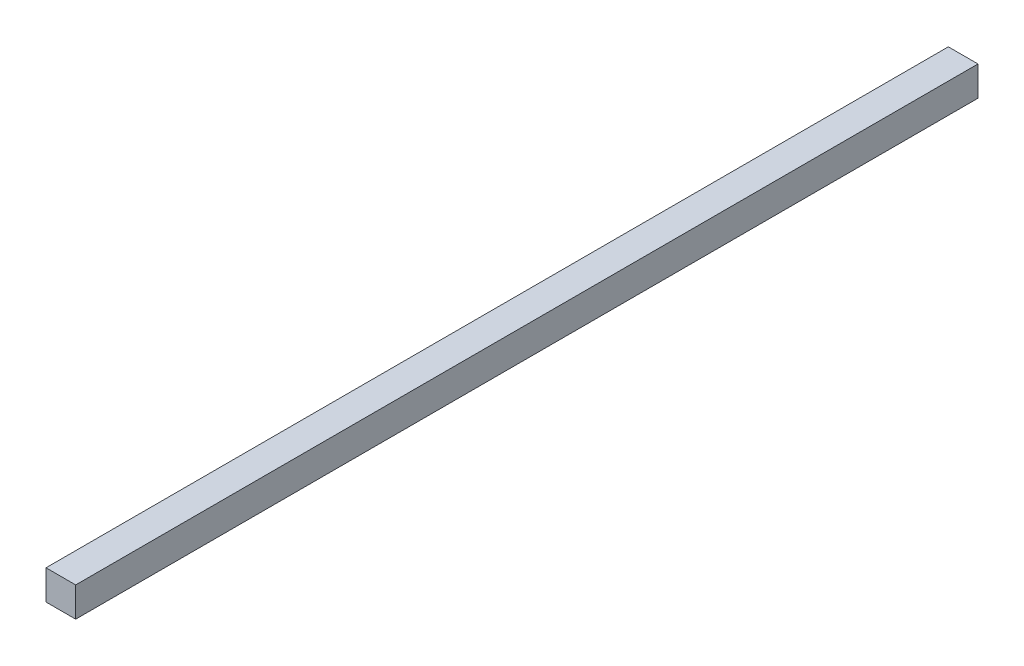
ISO-10303-21;
HEADER;
FILE_DESCRIPTION(('STEP AP214'),'2;1');
FILE_NAME('part.step','',(''),(''),'','','');
FILE_SCHEMA(('AUTOMOTIVE_DESIGN { 1 0 10303 214 1 1 1 1 }'));
ENDSEC;
DATA;
#1=APPLICATION_CONTEXT('core data for automotive mechanical design processes');
#2=APPLICATION_PROTOCOL_DEFINITION('international standard','automotive_design',2000,#1);
#3=PRODUCT_CONTEXT('',#1,'mechanical');
#4=PRODUCT('Part','Part','',(#3));
#5=PRODUCT_RELATED_PRODUCT_CATEGORY('part','',(#4));
#6=PRODUCT_DEFINITION_FORMATION('','',#4);
#7=PRODUCT_DEFINITION_CONTEXT('part definition',#1,'design');
#8=PRODUCT_DEFINITION('design','',#6,#7);
#9=PRODUCT_DEFINITION_SHAPE('','',#8);
#10=(LENGTH_UNIT() NAMED_UNIT(*) SI_UNIT(.MILLI.,.METRE.));
#11=(NAMED_UNIT(*) PLANE_ANGLE_UNIT() SI_UNIT($,.RADIAN.));
#12=(NAMED_UNIT(*) SI_UNIT($,.STERADIAN.) SOLID_ANGLE_UNIT());
#13=UNCERTAINTY_MEASURE_WITH_UNIT(LENGTH_MEASURE(1.E-05),#10,'distance_accuracy_value','');
#14=(GEOMETRIC_REPRESENTATION_CONTEXT(3) GLOBAL_UNCERTAINTY_ASSIGNED_CONTEXT((#13)) GLOBAL_UNIT_ASSIGNED_CONTEXT((#10,
#11,#12)) REPRESENTATION_CONTEXT('',''));
#15=CARTESIAN_POINT('',(0.,0.,0.));
#16=DIRECTION('',(0.,0.,1.));
#17=DIRECTION('',(1.,0.,0.));
#18=AXIS2_PLACEMENT_3D('',#15,#16,#17);
#19=CARTESIAN_POINT('',(12.7,0.,0.));
#20=DIRECTION('',(0.,1.,0.));
#21=DIRECTION('',(0.,0.,1.));
#22=AXIS2_PLACEMENT_3D('',#19,#20,#21);
#23=PLANE('',#22);
#24=DIRECTION('',(0.,0.,-1.));
#25=VECTOR('',#24,1.);
#26=CARTESIAN_POINT('',(0.,0.,0.));
#27=LINE('',#26,#25);
#28=CARTESIAN_POINT('',(0.,0.,0.));
#29=VERTEX_POINT('',#28);
#30=CARTESIAN_POINT('',(0.,0.,-386.08));
#31=VERTEX_POINT('',#30);
#32=EDGE_CURVE('E104',#29,#31,#27,.T.);
#33=ORIENTED_EDGE('',*,*,#32,.T.);
#34=DIRECTION('',(-1.,0.,0.));
#35=VECTOR('',#34,1.);
#36=CARTESIAN_POINT('',(12.7,0.,-386.08));
#37=LINE('',#36,#35);
#38=CARTESIAN_POINT('',(12.7,0.,-386.08));
#39=VERTEX_POINT('',#38);
#40=EDGE_CURVE('E11',#39,#31,#37,.T.);
#41=ORIENTED_EDGE('',*,*,#40,.F.);
#42=DIRECTION('',(0.,0.,-1.));
#43=VECTOR('',#42,1.);
#44=CARTESIAN_POINT('',(12.7,0.,0.));
#45=LINE('',#44,#43);
#46=CARTESIAN_POINT('',(12.7,0.,0.));
#47=VERTEX_POINT('',#46);
#48=EDGE_CURVE('E92',#47,#39,#45,.T.);
#49=ORIENTED_EDGE('',*,*,#48,.F.);
#50=DIRECTION('',(-1.,0.,0.));
#51=VECTOR('',#50,1.);
#52=CARTESIAN_POINT('',(12.7,0.,0.));
#53=LINE('',#52,#51);
#54=EDGE_CURVE('E100',#47,#29,#53,.T.);
#55=ORIENTED_EDGE('',*,*,#54,.T.);
#56=EDGE_LOOP('',(#33,#41,#49,#55));
#57=FACE_BOUND('',#56,.T.);
#58=ADVANCED_FACE('F41',(#57),#23,.F.);
#59=CARTESIAN_POINT('',(12.7,0.,-386.08));
#60=DIRECTION('',(0.,0.,1.));
#61=DIRECTION('',(1.,0.,0.));
#62=AXIS2_PLACEMENT_3D('',#59,#60,#61);
#63=PLANE('',#62);
#64=DIRECTION('',(0.,1.,0.));
#65=VECTOR('',#64,1.);
#66=CARTESIAN_POINT('',(0.,0.,-386.08));
#67=LINE('',#66,#65);
#68=CARTESIAN_POINT('',(0.,12.7,-386.08));
#69=VERTEX_POINT('',#68);
#70=EDGE_CURVE('E96',#31,#69,#67,.T.);
#71=ORIENTED_EDGE('',*,*,#70,.T.);
#72=DIRECTION('',(-1.,0.,0.));
#73=VECTOR('',#72,1.);
#74=CARTESIAN_POINT('',(12.7,12.7,-386.08));
#75=LINE('',#74,#73);
#76=CARTESIAN_POINT('',(12.7,12.7,-386.08));
#77=VERTEX_POINT('',#76);
#78=EDGE_CURVE('E49',#77,#69,#75,.T.);
#79=ORIENTED_EDGE('',*,*,#78,.F.);
#80=DIRECTION('',(0.,1.,0.));
#81=VECTOR('',#80,1.);
#82=CARTESIAN_POINT('',(12.7,0.,-386.08));
#83=LINE('',#82,#81);
#84=EDGE_CURVE('E87',#39,#77,#83,.T.);
#85=ORIENTED_EDGE('',*,*,#84,.F.);
#86=ORIENTED_EDGE('',*,*,#40,.T.);
#87=EDGE_LOOP('',(#71,#79,#85,#86));
#88=FACE_BOUND('',#87,.T.);
#89=ADVANCED_FACE('F95',(#88),#63,.F.);
#90=CARTESIAN_POINT('',(12.7,12.7,0.));
#91=DIRECTION('',(0.,-1.,0.));
#92=DIRECTION('',(0.,0.,-1.));
#93=AXIS2_PLACEMENT_3D('',#90,#91,#92);
#94=PLANE('',#93);
#95=DIRECTION('',(0.,0.,1.));
#96=VECTOR('',#95,1.);
#97=CARTESIAN_POINT('',(0.,12.7,0.));
#98=LINE('',#97,#96);
#99=CARTESIAN_POINT('',(0.,12.7,0.));
#100=VERTEX_POINT('',#99);
#101=EDGE_CURVE('E74',#69,#100,#98,.T.);
#102=ORIENTED_EDGE('',*,*,#101,.T.);
#103=DIRECTION('',(-1.,0.,0.));
#104=VECTOR('',#103,1.);
#105=CARTESIAN_POINT('',(12.7,12.7,0.));
#106=LINE('',#105,#104);
#107=CARTESIAN_POINT('',(12.7,12.7,0.));
#108=VERTEX_POINT('',#107);
#109=EDGE_CURVE('E97',#108,#100,#106,.T.);
#110=ORIENTED_EDGE('',*,*,#109,.F.);
#111=DIRECTION('',(0.,0.,1.));
#112=VECTOR('',#111,1.);
#113=CARTESIAN_POINT('',(12.7,12.7,0.));
#114=LINE('',#113,#112);
#115=EDGE_CURVE('E90',#77,#108,#114,.T.);
#116=ORIENTED_EDGE('',*,*,#115,.F.);
#117=ORIENTED_EDGE('',*,*,#78,.T.);
#118=EDGE_LOOP('',(#102,#110,#116,#117));
#119=FACE_BOUND('',#118,.T.);
#120=ADVANCED_FACE('F98',(#119),#94,.F.);
#121=CARTESIAN_POINT('',(12.7,12.7,0.));
#122=DIRECTION('',(0.,0.,-1.));
#123=DIRECTION('',(-1.,0.,0.));
#124=AXIS2_PLACEMENT_3D('',#121,#122,#123);
#125=PLANE('',#124);
#126=DIRECTION('',(0.,-1.,0.));
#127=VECTOR('',#126,1.);
#128=CARTESIAN_POINT('',(0.,12.7,0.));
#129=LINE('',#128,#127);
#130=EDGE_CURVE('E80',#100,#29,#129,.T.);
#131=ORIENTED_EDGE('',*,*,#130,.T.);
#132=ORIENTED_EDGE('',*,*,#54,.F.);
#133=DIRECTION('',(0.,-1.,0.));
#134=VECTOR('',#133,1.);
#135=CARTESIAN_POINT('',(12.7,12.7,0.));
#136=LINE('',#135,#134);
#137=EDGE_CURVE('E57',#108,#47,#136,.T.);
#138=ORIENTED_EDGE('',*,*,#137,.F.);
#139=ORIENTED_EDGE('',*,*,#109,.T.);
#140=EDGE_LOOP('',(#131,#132,#138,#139));
#141=FACE_BOUND('',#140,.T.);
#142=ADVANCED_FACE('F111',(#141),#125,.F.);
#143=CARTESIAN_POINT('',(12.7,0.,0.));
#144=DIRECTION('',(1.,0.,0.));
#145=DIRECTION('',(0.,0.,-1.));
#146=AXIS2_PLACEMENT_3D('',#143,#144,#145);
#147=PLANE('',#146);
#148=ORIENTED_EDGE('',*,*,#48,.T.);
#149=ORIENTED_EDGE('',*,*,#84,.T.);
#150=ORIENTED_EDGE('',*,*,#115,.T.);
#151=ORIENTED_EDGE('',*,*,#137,.T.);
#152=EDGE_LOOP('',(#148,#149,#150,#151));
#153=FACE_BOUND('',#152,.T.);
#154=ADVANCED_FACE('F88',(#153),#147,.T.);
#155=CARTESIAN_POINT('',(0.,0.,0.));
#156=DIRECTION('',(1.,0.,0.));
#157=DIRECTION('',(0.,0.,-1.));
#158=AXIS2_PLACEMENT_3D('',#155,#156,#157);
#159=PLANE('',#158);
#160=ORIENTED_EDGE('',*,*,#32,.F.);
#161=ORIENTED_EDGE('',*,*,#130,.F.);
#162=ORIENTED_EDGE('',*,*,#101,.F.);
#163=ORIENTED_EDGE('',*,*,#70,.F.);
#164=EDGE_LOOP('',(#160,#161,#162,#163));
#165=FACE_BOUND('',#164,.T.);
#166=ADVANCED_FACE('F114',(#165),#159,.F.);
#167=CLOSED_SHELL('',(#58,#89,#120,#142,#154,#166));
#168=MANIFOLD_SOLID_BREP('B2',#167);
#169=ADVANCED_BREP_SHAPE_REPRESENTATION('',(#18,#168),#14);
#170=SHAPE_DEFINITION_REPRESENTATION(#9,#169);
ENDSEC;
END-ISO-10303-21;
